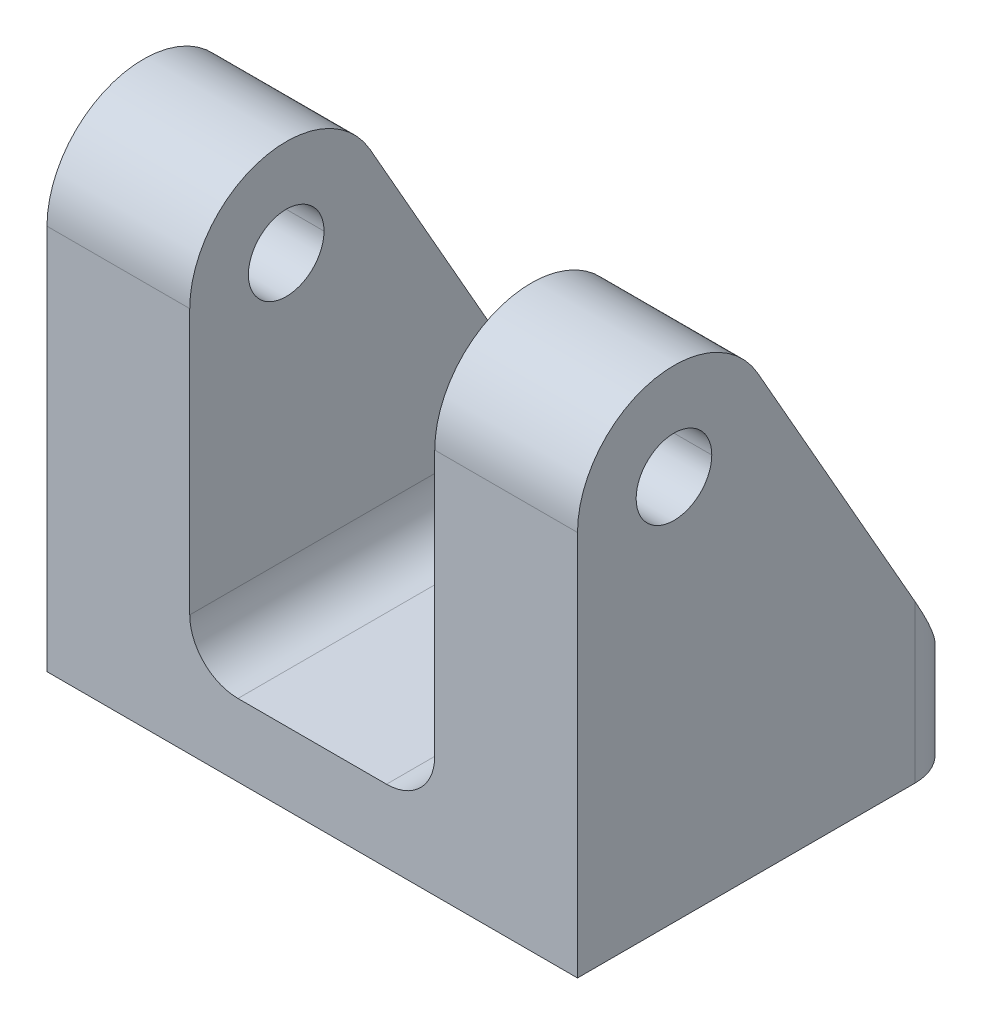
ISO-10303-21;
HEADER;
FILE_DESCRIPTION(('STEP AP214'),'2;1');
FILE_NAME('part.step','',(''),(''),'','','');
FILE_SCHEMA(('AUTOMOTIVE_DESIGN { 1 0 10303 214 1 1 1 1 }'));
ENDSEC;
DATA;
#1=APPLICATION_CONTEXT('core data for automotive mechanical design processes');
#2=APPLICATION_PROTOCOL_DEFINITION('international standard','automotive_design',2000,#1);
#3=PRODUCT_CONTEXT('',#1,'mechanical');
#4=PRODUCT('Part','Part','',(#3));
#5=PRODUCT_RELATED_PRODUCT_CATEGORY('part','',(#4));
#6=PRODUCT_DEFINITION_FORMATION('','',#4);
#7=PRODUCT_DEFINITION_CONTEXT('part definition',#1,'design');
#8=PRODUCT_DEFINITION('design','',#6,#7);
#9=PRODUCT_DEFINITION_SHAPE('','',#8);
#10=(LENGTH_UNIT() NAMED_UNIT(*) SI_UNIT(.MILLI.,.METRE.));
#11=(NAMED_UNIT(*) PLANE_ANGLE_UNIT() SI_UNIT($,.RADIAN.));
#12=(NAMED_UNIT(*) SI_UNIT($,.STERADIAN.) SOLID_ANGLE_UNIT());
#13=UNCERTAINTY_MEASURE_WITH_UNIT(LENGTH_MEASURE(1.E-05),#10,'distance_accuracy_value','');
#14=(GEOMETRIC_REPRESENTATION_CONTEXT(3) GLOBAL_UNCERTAINTY_ASSIGNED_CONTEXT((#13)) GLOBAL_UNIT_ASSIGNED_CONTEXT((#10,
#11,#12)) REPRESENTATION_CONTEXT('',''));
#15=CARTESIAN_POINT('',(0.,0.,0.));
#16=DIRECTION('',(0.,0.,1.));
#17=DIRECTION('',(1.,0.,0.));
#18=AXIS2_PLACEMENT_3D('',#15,#16,#17);
#19=CARTESIAN_POINT('',(4.8895,7.9375,-12.7));
#20=DIRECTION('',(0.,0.,-1.));
#21=DIRECTION('',(-1.,0.,0.));
#22=AXIS2_PLACEMENT_3D('',#19,#20,#21);
#23=CYLINDRICAL_SURFACE('',#22,3.175);
#24=CARTESIAN_POINT('',(4.8895,4.7625,-12.7));
#25=CARTESIAN_POINT('',(6.74937193946543,4.7625,-12.7));
#26=CARTESIAN_POINT('',(8.06450000000001,6.07762806053458,-11.9516212349029));
#27=CARTESIAN_POINT('',(8.0645,7.9375,-10.8932538355104));
#28=(BOUNDED_CURVE() B_SPLINE_CURVE(3,(#24,#25,#26,#27),.UNSPECIFIED.,.F.,
.F.) B_SPLINE_CURVE_WITH_KNOTS((4,4),(0.,1.5707963267949),
.UNSPECIFIED.) CURVE() GEOMETRIC_REPRESENTATION_ITEM() RATIONAL_B_SPLINE_CURVE((1.,
0.804737854124365,0.804737854124365,1.)) REPRESENTATION_ITEM(''));
#29=CARTESIAN_POINT('',(4.8895,4.7625,-12.7));
#30=VERTEX_POINT('',#29);
#31=CARTESIAN_POINT('',(8.0645,7.9375,-10.8932538355104));
#32=VERTEX_POINT('',#31);
#33=EDGE_CURVE('E396',#30,#32,#28,.T.);
#34=ORIENTED_EDGE('',*,*,#33,.F.);
#35=DIRECTION('',(0.,0.,-1.));
#36=VECTOR('',#35,1.);
#37=CARTESIAN_POINT('',(4.8895,4.7625,-12.7));
#38=LINE('',#37,#36);
#39=CARTESIAN_POINT('',(4.8895,4.7625,12.7));
#40=VERTEX_POINT('',#39);
#41=EDGE_CURVE('E316',#40,#30,#38,.T.);
#42=ORIENTED_EDGE('',*,*,#41,.F.);
#43=CARTESIAN_POINT('',(4.8895,7.9375,12.7));
#44=DIRECTION('',(0.,0.,-1.));
#45=DIRECTION('',(0.,-1.,0.));
#46=AXIS2_PLACEMENT_3D('',#43,#44,#45);
#47=CIRCLE('',#46,3.175);
#48=CARTESIAN_POINT('',(8.0645,7.9375,12.7));
#49=VERTEX_POINT('',#48);
#50=EDGE_CURVE('E467',#49,#40,#47,.T.);
#51=ORIENTED_EDGE('',*,*,#50,.F.);
#52=DIRECTION('',(0.,0.,1.));
#53=VECTOR('',#52,1.);
#54=CARTESIAN_POINT('',(8.0645,7.9375,12.7));
#55=LINE('',#54,#53);
#56=EDGE_CURVE('E317',#32,#49,#55,.T.);
#57=ORIENTED_EDGE('',*,*,#56,.F.);
#58=EDGE_LOOP('',(#34,#42,#51,#57));
#59=FACE_BOUND('',#58,.T.);
#60=ADVANCED_FACE('F16',(#59),#23,.F.);
#61=CARTESIAN_POINT('',(-4.8895,7.9375,-12.7));
#62=DIRECTION('',(0.,0.,-1.));
#63=DIRECTION('',(-1.,0.,0.));
#64=AXIS2_PLACEMENT_3D('',#61,#62,#63);
#65=CYLINDRICAL_SURFACE('',#64,3.175);
#66=CARTESIAN_POINT('',(-8.0645,7.9375,-10.8932538355104));
#67=CARTESIAN_POINT('',(-8.0645,6.07762806053458,-11.9516212349029));
#68=CARTESIAN_POINT('',(-6.74937193946543,4.7625,-12.7));
#69=CARTESIAN_POINT('',(-4.8895,4.7625,-12.7));
#70=(BOUNDED_CURVE() B_SPLINE_CURVE(3,(#66,#67,#68,#69),.UNSPECIFIED.,.F.,
.F.) B_SPLINE_CURVE_WITH_KNOTS((4,4),(4.71238898038469,6.28318530717959),
.UNSPECIFIED.) CURVE() GEOMETRIC_REPRESENTATION_ITEM() RATIONAL_B_SPLINE_CURVE((1.,
0.804737854124365,0.804737854124365,1.)) REPRESENTATION_ITEM(''));
#71=CARTESIAN_POINT('',(-8.0645,7.9375,-10.8932538355104));
#72=VERTEX_POINT('',#71);
#73=CARTESIAN_POINT('',(-4.8895,4.7625,-12.7));
#74=VERTEX_POINT('',#73);
#75=EDGE_CURVE('E269',#72,#74,#70,.T.);
#76=ORIENTED_EDGE('',*,*,#75,.F.);
#77=DIRECTION('',(0.,0.,-1.));
#78=VECTOR('',#77,1.);
#79=CARTESIAN_POINT('',(-8.0645,7.9375,-12.7));
#80=LINE('',#79,#78);
#81=CARTESIAN_POINT('',(-8.0645,7.9375,12.7));
#82=VERTEX_POINT('',#81);
#83=EDGE_CURVE('E352',#82,#72,#80,.T.);
#84=ORIENTED_EDGE('',*,*,#83,.F.);
#85=CARTESIAN_POINT('',(-4.8895,7.9375,12.7));
#86=DIRECTION('',(0.,0.,-1.));
#87=DIRECTION('',(0.,-1.,0.));
#88=AXIS2_PLACEMENT_3D('',#85,#86,#87);
#89=CIRCLE('',#88,3.175);
#90=CARTESIAN_POINT('',(-4.8895,4.7625,12.7));
#91=VERTEX_POINT('',#90);
#92=EDGE_CURVE('E295',#91,#82,#89,.T.);
#93=ORIENTED_EDGE('',*,*,#92,.F.);
#94=DIRECTION('',(0.,0.,1.));
#95=VECTOR('',#94,1.);
#96=CARTESIAN_POINT('',(-4.8895,4.7625,12.7));
#97=LINE('',#96,#95);
#98=EDGE_CURVE('E312',#74,#91,#97,.T.);
#99=ORIENTED_EDGE('',*,*,#98,.F.);
#100=EDGE_LOOP('',(#76,#84,#93,#99));
#101=FACE_BOUND('',#100,.T.);
#102=ADVANCED_FACE('F553',(#101),#65,.F.);
#103=CARTESIAN_POINT('',(12.7,0.,0.));
#104=DIRECTION('',(0.,-1.,0.));
#105=DIRECTION('',(0.,0.,-1.));
#106=AXIS2_PLACEMENT_3D('',#103,#104,#105);
#107=CYLINDRICAL_SURFACE('',#106,2.0193);
#108=DIRECTION('',(0.,-1.,0.));
#109=VECTOR('',#108,1.);
#110=CARTESIAN_POINT('',(12.7,0.,2.0193));
#111=LINE('',#110,#109);
#112=CARTESIAN_POINT('',(12.7,19.05,2.0193));
#113=VERTEX_POINT('',#112);
#114=CARTESIAN_POINT('',(12.7,0.,2.0193));
#115=VERTEX_POINT('',#114);
#116=EDGE_CURVE('E379',#113,#115,#111,.T.);
#117=ORIENTED_EDGE('',*,*,#116,.F.);
#118=CARTESIAN_POINT('',(12.7,19.05,0.));
#119=DIRECTION('',(0.,-1.,0.));
#120=DIRECTION('',(0.,0.,-1.));
#121=AXIS2_PLACEMENT_3D('',#118,#119,#120);
#122=CIRCLE('',#121,2.0193);
#123=CARTESIAN_POINT('',(12.7,19.05,-2.0193));
#124=VERTEX_POINT('',#123);
#125=EDGE_CURVE('E11',#124,#113,#122,.T.);
#126=ORIENTED_EDGE('',*,*,#125,.F.);
#127=DIRECTION('',(0.,-1.,0.));
#128=VECTOR('',#127,1.);
#129=CARTESIAN_POINT('',(12.7,0.,-2.0193));
#130=LINE('',#129,#128);
#131=CARTESIAN_POINT('',(12.7,0.,-2.0193));
#132=VERTEX_POINT('',#131);
#133=EDGE_CURVE('E320',#124,#132,#130,.T.);
#134=ORIENTED_EDGE('',*,*,#133,.T.);
#135=CARTESIAN_POINT('',(12.7,0.,0.));
#136=DIRECTION('',(0.,-1.,0.));
#137=DIRECTION('',(0.,0.,-1.));
#138=AXIS2_PLACEMENT_3D('',#135,#136,#137);
#139=CIRCLE('',#138,2.0193);
#140=EDGE_CURVE('E334',#132,#115,#139,.T.);
#141=ORIENTED_EDGE('',*,*,#140,.T.);
#142=EDGE_LOOP('',(#117,#126,#134,#141));
#143=FACE_BOUND('',#142,.T.);
#144=ADVANCED_FACE('F532',(#143),#107,.F.);
#145=CARTESIAN_POINT('',(12.7,19.05,0.));
#146=DIRECTION('',(0.,-1.,0.));
#147=DIRECTION('',(0.,0.,-1.));
#148=AXIS2_PLACEMENT_3D('',#145,#146,#147);
#149=CONICAL_SURFACE('',#148,2.0193,1.02974425867665);
#150=DIRECTION('',(0.,-0.515038074910057,0.857167300702111));
#151=VECTOR('',#150,1.);
#152=CARTESIAN_POINT('',(12.7,19.05,2.0193));
#153=LINE('',#152,#151);
#154=CARTESIAN_POINT('',(12.7,20.2633178480023,0.));
#155=VERTEX_POINT('',#154);
#156=EDGE_CURVE('E201',#155,#113,#153,.T.);
#157=ORIENTED_EDGE('',*,*,#156,.F.);
#158=DIRECTION('',(0.,-0.515038074910057,-0.857167300702111));
#159=VECTOR('',#158,1.);
#160=CARTESIAN_POINT('',(12.7,19.05,-2.0193));
#161=LINE('',#160,#159);
#162=EDGE_CURVE('E299',#155,#124,#161,.T.);
#163=ORIENTED_EDGE('',*,*,#162,.T.);
#164=ORIENTED_EDGE('',*,*,#125,.T.);
#165=EDGE_LOOP('',(#157,#163,#164));
#166=FACE_BOUND('',#165,.T.);
#167=ADVANCED_FACE('F541',(#166),#149,.F.);
#168=CARTESIAN_POINT('',(-12.7,0.,0.));
#169=DIRECTION('',(0.,-1.,0.));
#170=DIRECTION('',(0.,0.,-1.));
#171=AXIS2_PLACEMENT_3D('',#168,#169,#170);
#172=CYLINDRICAL_SURFACE('',#171,2.0193);
#173=DIRECTION('',(0.,-1.,0.));
#174=VECTOR('',#173,1.);
#175=CARTESIAN_POINT('',(-12.7,0.,2.0193));
#176=LINE('',#175,#174);
#177=CARTESIAN_POINT('',(-12.7,19.05,2.0193));
#178=VERTEX_POINT('',#177);
#179=CARTESIAN_POINT('',(-12.7,0.,2.0193));
#180=VERTEX_POINT('',#179);
#181=EDGE_CURVE('E329',#178,#180,#176,.T.);
#182=ORIENTED_EDGE('',*,*,#181,.F.);
#183=CARTESIAN_POINT('',(-12.7,19.05,0.));
#184=DIRECTION('',(0.,-1.,0.));
#185=DIRECTION('',(0.,0.,-1.));
#186=AXIS2_PLACEMENT_3D('',#183,#184,#185);
#187=CIRCLE('',#186,2.0193);
#188=CARTESIAN_POINT('',(-12.7,19.05,-2.0193));
#189=VERTEX_POINT('',#188);
#190=EDGE_CURVE('E27',#189,#178,#187,.T.);
#191=ORIENTED_EDGE('',*,*,#190,.F.);
#192=DIRECTION('',(0.,-1.,0.));
#193=VECTOR('',#192,1.);
#194=CARTESIAN_POINT('',(-12.7,0.,-2.0193));
#195=LINE('',#194,#193);
#196=CARTESIAN_POINT('',(-12.7,0.,-2.0193));
#197=VERTEX_POINT('',#196);
#198=EDGE_CURVE('E328',#189,#197,#195,.T.);
#199=ORIENTED_EDGE('',*,*,#198,.T.);
#200=CARTESIAN_POINT('',(-12.7,0.,0.));
#201=DIRECTION('',(0.,-1.,0.));
#202=DIRECTION('',(0.,0.,-1.));
#203=AXIS2_PLACEMENT_3D('',#200,#201,#202);
#204=CIRCLE('',#203,2.0193);
#205=EDGE_CURVE('E330',#197,#180,#204,.T.);
#206=ORIENTED_EDGE('',*,*,#205,.T.);
#207=EDGE_LOOP('',(#182,#191,#199,#206));
#208=FACE_BOUND('',#207,.T.);
#209=ADVANCED_FACE('F543',(#208),#172,.F.);
#210=CARTESIAN_POINT('',(-12.7,19.05,0.));
#211=DIRECTION('',(0.,-1.,0.));
#212=DIRECTION('',(0.,0.,-1.));
#213=AXIS2_PLACEMENT_3D('',#210,#211,#212);
#214=CONICAL_SURFACE('',#213,2.0193,1.02974425867665);
#215=DIRECTION('',(0.,-0.515038074910057,0.857167300702111));
#216=VECTOR('',#215,1.);
#217=CARTESIAN_POINT('',(-12.7,19.05,2.0193));
#218=LINE('',#217,#216);
#219=CARTESIAN_POINT('',(-12.7,20.2633178480023,0.));
#220=VERTEX_POINT('',#219);
#221=EDGE_CURVE('E465',#220,#178,#218,.T.);
#222=ORIENTED_EDGE('',*,*,#221,.F.);
#223=DIRECTION('',(0.,-0.515038074910057,-0.857167300702111));
#224=VECTOR('',#223,1.);
#225=CARTESIAN_POINT('',(-12.7,19.05,-2.0193));
#226=LINE('',#225,#224);
#227=EDGE_CURVE('E462',#220,#189,#226,.T.);
#228=ORIENTED_EDGE('',*,*,#227,.T.);
#229=ORIENTED_EDGE('',*,*,#190,.T.);
#230=EDGE_LOOP('',(#222,#228,#229));
#231=FACE_BOUND('',#230,.T.);
#232=ADVANCED_FACE('F550',(#231),#214,.F.);
#233=CARTESIAN_POINT('',(0.,0.,0.));
#234=DIRECTION('',(0.,-1.,0.));
#235=DIRECTION('',(0.,0.,-1.));
#236=AXIS2_PLACEMENT_3D('',#233,#234,#235);
#237=CYLINDRICAL_SURFACE('',#236,2.0193);
#238=DIRECTION('',(0.,-1.,0.));
#239=VECTOR('',#238,1.);
#240=CARTESIAN_POINT('',(0.,0.,2.0193));
#241=LINE('',#240,#239);
#242=CARTESIAN_POINT('',(0.,4.7625,2.0193));
#243=VERTEX_POINT('',#242);
#244=CARTESIAN_POINT('',(0.,0.,2.0193));
#245=VERTEX_POINT('',#244);
#246=EDGE_CURVE('E289',#243,#245,#241,.T.);
#247=ORIENTED_EDGE('',*,*,#246,.F.);
#248=CARTESIAN_POINT('',(0.,4.7625,0.));
#249=DIRECTION('',(0.,-1.,0.));
#250=DIRECTION('',(1.,0.,0.));
#251=AXIS2_PLACEMENT_3D('',#248,#249,#250);
#252=CIRCLE('',#251,2.0193);
#253=CARTESIAN_POINT('',(0.,4.7625,-2.0193));
#254=VERTEX_POINT('',#253);
#255=EDGE_CURVE('E405',#254,#243,#252,.T.);
#256=ORIENTED_EDGE('',*,*,#255,.F.);
#257=DIRECTION('',(0.,-1.,0.));
#258=VECTOR('',#257,1.);
#259=CARTESIAN_POINT('',(0.,0.,-2.0193));
#260=LINE('',#259,#258);
#261=CARTESIAN_POINT('',(0.,0.,-2.0193));
#262=VERTEX_POINT('',#261);
#263=EDGE_CURVE('E288',#254,#262,#260,.T.);
#264=ORIENTED_EDGE('',*,*,#263,.T.);
#265=CARTESIAN_POINT('',(0.,0.,0.));
#266=DIRECTION('',(0.,-1.,0.));
#267=DIRECTION('',(0.,0.,-1.));
#268=AXIS2_PLACEMENT_3D('',#265,#266,#267);
#269=CIRCLE('',#268,2.0193);
#270=EDGE_CURVE('E333',#262,#245,#269,.T.);
#271=ORIENTED_EDGE('',*,*,#270,.T.);
#272=EDGE_LOOP('',(#247,#256,#264,#271));
#273=FACE_BOUND('',#272,.T.);
#274=ADVANCED_FACE('F613',(#273),#237,.F.);
#275=CARTESIAN_POINT('',(-14.2875,0.,-9.525));
#276=DIRECTION('',(0.,1.,0.));
#277=DIRECTION('',(0.,0.,1.));
#278=AXIS2_PLACEMENT_3D('',#275,#276,#277);
#279=CYLINDRICAL_SURFACE('',#278,3.175);
#280=CARTESIAN_POINT('',(-14.2875,4.7625,-12.7));
#281=CARTESIAN_POINT('',(-16.1473719394654,4.76250000000002,-12.7));
#282=CARTESIAN_POINT('',(-17.4625,7.07357815489786,-11.3848719394654));
#283=CARTESIAN_POINT('',(-17.4625,10.3419362252586,-9.525));
#284=(BOUNDED_CURVE() B_SPLINE_CURVE(3,(#280,#281,#282,#283),.UNSPECIFIED.,.F.,
.F.) B_SPLINE_CURVE_WITH_KNOTS((4,4),(3.1415926535898,4.71238898038469),
.UNSPECIFIED.) CURVE() GEOMETRIC_REPRESENTATION_ITEM() RATIONAL_B_SPLINE_CURVE((1.,
0.804737854124365,0.804737854124365,1.)) REPRESENTATION_ITEM(''));
#285=CARTESIAN_POINT('',(-14.2875,4.7625,-12.7));
#286=VERTEX_POINT('',#285);
#287=CARTESIAN_POINT('',(-17.4625,10.3419362252586,-9.525));
#288=VERTEX_POINT('',#287);
#289=EDGE_CURVE('E447',#286,#288,#284,.T.);
#290=ORIENTED_EDGE('',*,*,#289,.F.);
#291=DIRECTION('',(0.,1.,0.));
#292=VECTOR('',#291,1.);
#293=CARTESIAN_POINT('',(-14.2875,4.7625,-12.7));
#294=LINE('',#293,#292);
#295=CARTESIAN_POINT('',(-14.2875,0.,-12.7));
#296=VERTEX_POINT('',#295);
#297=EDGE_CURVE('E492',#296,#286,#294,.T.);
#298=ORIENTED_EDGE('',*,*,#297,.F.);
#299=CARTESIAN_POINT('',(-14.2875,0.,-9.525));
#300=DIRECTION('',(0.,-1.,0.));
#301=DIRECTION('',(0.,0.,-1.));
#302=AXIS2_PLACEMENT_3D('',#299,#300,#301);
#303=CIRCLE('',#302,3.175);
#304=CARTESIAN_POINT('',(-17.4625,0.,-9.525));
#305=VERTEX_POINT('',#304);
#306=EDGE_CURVE('E341',#305,#296,#303,.T.);
#307=ORIENTED_EDGE('',*,*,#306,.F.);
#308=DIRECTION('',(0.,-1.,0.));
#309=VECTOR('',#308,1.);
#310=CARTESIAN_POINT('',(-17.4625,0.,-9.525));
#311=LINE('',#310,#309);
#312=EDGE_CURVE('E42',#288,#305,#311,.T.);
#313=ORIENTED_EDGE('',*,*,#312,.F.);
#314=EDGE_LOOP('',(#290,#298,#307,#313));
#315=FACE_BOUND('',#314,.T.);
#316=ADVANCED_FACE('F572',(#315),#279,.T.);
#317=CARTESIAN_POINT('',(14.2875,0.,-9.525));
#318=DIRECTION('',(0.,-1.,0.));
#319=DIRECTION('',(0.,0.,-1.));
#320=AXIS2_PLACEMENT_3D('',#317,#318,#319);
#321=CYLINDRICAL_SURFACE('',#320,3.175);
#322=CARTESIAN_POINT('',(17.4625,10.3419362252586,-9.525));
#323=CARTESIAN_POINT('',(17.4625,7.07357815489786,-11.3848719394654));
#324=CARTESIAN_POINT('',(16.1473719394654,4.76250000000001,-12.7));
#325=CARTESIAN_POINT('',(14.2875,4.7625,-12.7));
#326=(BOUNDED_CURVE() B_SPLINE_CURVE(3,(#322,#323,#324,#325),.UNSPECIFIED.,.F.,
.F.) B_SPLINE_CURVE_WITH_KNOTS((4,4),(4.71238898038469,6.28318530717959),
.UNSPECIFIED.) CURVE() GEOMETRIC_REPRESENTATION_ITEM() RATIONAL_B_SPLINE_CURVE((1.,
0.804737854124365,0.804737854124365,1.)) REPRESENTATION_ITEM(''));
#327=CARTESIAN_POINT('',(17.4625,10.3419362252586,-9.525));
#328=VERTEX_POINT('',#327);
#329=CARTESIAN_POINT('',(14.2875,4.7625,-12.7));
#330=VERTEX_POINT('',#329);
#331=EDGE_CURVE('E355',#328,#330,#326,.T.);
#332=ORIENTED_EDGE('',*,*,#331,.F.);
#333=DIRECTION('',(0.,1.,0.));
#334=VECTOR('',#333,1.);
#335=CARTESIAN_POINT('',(17.4625,0.,-9.525));
#336=LINE('',#335,#334);
#337=CARTESIAN_POINT('',(17.4625,0.,-9.525));
#338=VERTEX_POINT('',#337);
#339=EDGE_CURVE('E374',#338,#328,#336,.T.);
#340=ORIENTED_EDGE('',*,*,#339,.F.);
#341=CARTESIAN_POINT('',(14.2875,0.,-9.525));
#342=DIRECTION('',(0.,-1.,0.));
#343=DIRECTION('',(0.,0.,-1.));
#344=AXIS2_PLACEMENT_3D('',#341,#342,#343);
#345=CIRCLE('',#344,3.175);
#346=CARTESIAN_POINT('',(14.2875,0.,-12.7));
#347=VERTEX_POINT('',#346);
#348=EDGE_CURVE('E294',#347,#338,#345,.T.);
#349=ORIENTED_EDGE('',*,*,#348,.F.);
#350=DIRECTION('',(0.,-1.,0.));
#351=VECTOR('',#350,1.);
#352=CARTESIAN_POINT('',(14.2875,0.,-12.7));
#353=LINE('',#352,#351);
#354=EDGE_CURVE('E399',#330,#347,#353,.T.);
#355=ORIENTED_EDGE('',*,*,#354,.F.);
#356=EDGE_LOOP('',(#332,#340,#349,#355));
#357=FACE_BOUND('',#356,.T.);
#358=ADVANCED_FACE('F568',(#357),#321,.T.);
#359=CARTESIAN_POINT('',(-8.0645,4.7625,-12.7));
#360=DIRECTION('',(0.,-1.,0.));
#361=DIRECTION('',(0.,0.,-1.));
#362=AXIS2_PLACEMENT_3D('',#359,#360,#361);
#363=PLANE('',#362);
#364=ORIENTED_EDGE('',*,*,#255,.T.);
#365=CARTESIAN_POINT('',(0.,4.7625,0.));
#366=DIRECTION('',(0.,-1.,0.));
#367=DIRECTION('',(1.,0.,0.));
#368=AXIS2_PLACEMENT_3D('',#365,#366,#367);
#369=CIRCLE('',#368,2.0193);
#370=EDGE_CURVE('E348',#243,#254,#369,.T.);
#371=ORIENTED_EDGE('',*,*,#370,.T.);
#372=EDGE_LOOP('',(#364,#371));
#373=FACE_BOUND('',#372,.T.);
#374=DIRECTION('',(1.,0.,0.));
#375=VECTOR('',#374,1.);
#376=CARTESIAN_POINT('',(-8.0645,4.7625,-12.7));
#377=LINE('',#376,#375);
#378=EDGE_CURVE('E488',#74,#30,#377,.T.);
#379=ORIENTED_EDGE('',*,*,#378,.F.);
#380=ORIENTED_EDGE('',*,*,#98,.T.);
#381=DIRECTION('',(1.,0.,0.));
#382=VECTOR('',#381,1.);
#383=CARTESIAN_POINT('',(-8.0645,4.7625,12.7));
#384=LINE('',#383,#382);
#385=EDGE_CURVE('E340',#91,#40,#384,.T.);
#386=ORIENTED_EDGE('',*,*,#385,.T.);
#387=ORIENTED_EDGE('',*,*,#41,.T.);
#388=EDGE_LOOP('',(#379,#380,#386,#387));
#389=FACE_BOUND('',#388,.T.);
#390=ADVANCED_FACE('F571',(#373,#389),#363,.F.);
#391=CARTESIAN_POINT('',(8.0645,4.7625,-12.7));
#392=DIRECTION('',(1.,0.,0.));
#393=DIRECTION('',(0.,1.,0.));
#394=AXIS2_PLACEMENT_3D('',#391,#392,#393);
#395=PLANE('',#394);
#396=CARTESIAN_POINT('',(8.0645,25.4,6.35));
#397=DIRECTION('',(1.,0.,0.));
#398=DIRECTION('',(0.,1.,0.));
#399=AXIS2_PLACEMENT_3D('',#396,#397,#398);
#400=CIRCLE('',#399,2.4892);
#401=CARTESIAN_POINT('',(8.0645,25.4,8.8392));
#402=VERTEX_POINT('',#401);
#403=CARTESIAN_POINT('',(8.0645,25.4,3.8608));
#404=VERTEX_POINT('',#403);
#405=EDGE_CURVE('E304',#402,#404,#400,.T.);
#406=ORIENTED_EDGE('',*,*,#405,.T.);
#407=CARTESIAN_POINT('',(8.0645,25.4,6.35));
#408=DIRECTION('',(1.,0.,0.));
#409=DIRECTION('',(0.,1.,0.));
#410=AXIS2_PLACEMENT_3D('',#407,#408,#409);
#411=CIRCLE('',#410,2.4892);
#412=EDGE_CURVE('E402',#404,#402,#411,.T.);
#413=ORIENTED_EDGE('',*,*,#412,.T.);
#414=EDGE_LOOP('',(#406,#413));
#415=FACE_BOUND('',#414,.T.);
#416=DIRECTION('',(0.,0.869130808993556,0.494582285224821));
#417=VECTOR('',#416,1.);
#418=CARTESIAN_POINT('',(8.0645,6.62414303176311,-11.6406247536105));
#419=LINE('',#418,#417);
#420=CARTESIAN_POINT('',(8.0645,28.5405975111776,0.831019362890917));
#421=VERTEX_POINT('',#420);
#422=EDGE_CURVE('E413',#32,#421,#419,.T.);
#423=ORIENTED_EDGE('',*,*,#422,.F.);
#424=ORIENTED_EDGE('',*,*,#56,.T.);
#425=DIRECTION('',(0.,1.,0.));
#426=VECTOR('',#425,1.);
#427=CARTESIAN_POINT('',(8.0645,4.7625,12.7));
#428=LINE('',#427,#426);
#429=CARTESIAN_POINT('',(8.0645,25.4,12.7));
#430=VERTEX_POINT('',#429);
#431=EDGE_CURVE('E282',#49,#430,#428,.T.);
#432=ORIENTED_EDGE('',*,*,#431,.T.);
#433=CARTESIAN_POINT('',(8.0645,25.4,6.35));
#434=DIRECTION('',(1.,0.,0.));
#435=DIRECTION('',(0.,1.,0.));
#436=AXIS2_PLACEMENT_3D('',#433,#434,#435);
#437=CIRCLE('',#436,6.35);
#438=EDGE_CURVE('E414',#421,#430,#437,.T.);
#439=ORIENTED_EDGE('',*,*,#438,.F.);
#440=EDGE_LOOP('',(#423,#424,#432,#439));
#441=FACE_BOUND('',#440,.T.);
#442=ADVANCED_FACE('F598',(#415,#441),#395,.F.);
#443=CARTESIAN_POINT('',(-8.0645,4.7625,-12.7));
#444=DIRECTION('',(-1.,0.,0.));
#445=DIRECTION('',(0.,0.,1.));
#446=AXIS2_PLACEMENT_3D('',#443,#444,#445);
#447=PLANE('',#446);
#448=CARTESIAN_POINT('',(-8.0645,25.4,6.35));
#449=DIRECTION('',(-1.,0.,0.));
#450=DIRECTION('',(0.,0.,1.));
#451=AXIS2_PLACEMENT_3D('',#448,#449,#450);
#452=CIRCLE('',#451,2.4892);
#453=CARTESIAN_POINT('',(-8.0645,25.4,8.8392));
#454=VERTEX_POINT('',#453);
#455=CARTESIAN_POINT('',(-8.0645,25.4,3.8608));
#456=VERTEX_POINT('',#455);
#457=EDGE_CURVE('E261',#454,#456,#452,.T.);
#458=ORIENTED_EDGE('',*,*,#457,.T.);
#459=CARTESIAN_POINT('',(-8.0645,25.4,6.35));
#460=DIRECTION('',(-1.,0.,0.));
#461=DIRECTION('',(0.,0.,1.));
#462=AXIS2_PLACEMENT_3D('',#459,#460,#461);
#463=CIRCLE('',#462,2.4892);
#464=EDGE_CURVE('E363',#456,#454,#463,.T.);
#465=ORIENTED_EDGE('',*,*,#464,.T.);
#466=EDGE_LOOP('',(#458,#465));
#467=FACE_BOUND('',#466,.T.);
#468=DIRECTION('',(0.,-1.,0.));
#469=VECTOR('',#468,1.);
#470=CARTESIAN_POINT('',(-8.0645,4.7625,12.7));
#471=LINE('',#470,#469);
#472=CARTESIAN_POINT('',(-8.0645,25.4,12.7));
#473=VERTEX_POINT('',#472);
#474=EDGE_CURVE('E251',#473,#82,#471,.T.);
#475=ORIENTED_EDGE('',*,*,#474,.T.);
#476=ORIENTED_EDGE('',*,*,#83,.T.);
#477=DIRECTION('',(0.,-0.869130808993556,-0.494582285224821));
#478=VECTOR('',#477,1.);
#479=CARTESIAN_POINT('',(-8.0645,6.62414303176311,-11.6406247536105));
#480=LINE('',#479,#478);
#481=CARTESIAN_POINT('',(-8.0645,28.5405975111776,0.831019362890917));
#482=VERTEX_POINT('',#481);
#483=EDGE_CURVE('E278',#482,#72,#480,.T.);
#484=ORIENTED_EDGE('',*,*,#483,.F.);
#485=CARTESIAN_POINT('',(-8.0645,25.4,6.35));
#486=DIRECTION('',(-1.,0.,0.));
#487=DIRECTION('',(0.,0.,1.));
#488=AXIS2_PLACEMENT_3D('',#485,#486,#487);
#489=CIRCLE('',#488,6.35);
#490=EDGE_CURVE('E262',#473,#482,#489,.T.);
#491=ORIENTED_EDGE('',*,*,#490,.F.);
#492=EDGE_LOOP('',(#475,#476,#484,#491));
#493=FACE_BOUND('',#492,.T.);
#494=ADVANCED_FACE('F601',(#467,#493),#447,.F.);
#495=CARTESIAN_POINT('',(-17.4625,0.,0.));
#496=DIRECTION('',(1.,0.,0.));
#497=DIRECTION('',(0.,1.,0.));
#498=AXIS2_PLACEMENT_3D('',#495,#496,#497);
#499=PLANE('',#498);
#500=CARTESIAN_POINT('',(-17.4625,25.4,6.35));
#501=DIRECTION('',(1.,0.,0.));
#502=DIRECTION('',(0.,0.,-1.));
#503=AXIS2_PLACEMENT_3D('',#500,#501,#502);
#504=CIRCLE('',#503,2.4892);
#505=CARTESIAN_POINT('',(-17.4625,25.4,8.8392));
#506=VERTEX_POINT('',#505);
#507=CARTESIAN_POINT('',(-17.4625,25.4,3.8608));
#508=VERTEX_POINT('',#507);
#509=EDGE_CURVE('E505',#506,#508,#504,.T.);
#510=ORIENTED_EDGE('',*,*,#509,.T.);
#511=CARTESIAN_POINT('',(-17.4625,25.4,6.35));
#512=DIRECTION('',(1.,0.,0.));
#513=DIRECTION('',(0.,0.,-1.));
#514=AXIS2_PLACEMENT_3D('',#511,#512,#513);
#515=CIRCLE('',#514,2.4892);
#516=EDGE_CURVE('E311',#508,#506,#515,.T.);
#517=ORIENTED_EDGE('',*,*,#516,.T.);
#518=EDGE_LOOP('',(#510,#517));
#519=FACE_BOUND('',#518,.T.);
#520=DIRECTION('',(0.,0.869130808993556,0.494582285224821));
#521=VECTOR('',#520,1.);
#522=CARTESIAN_POINT('',(-17.4625,6.62414303176311,-11.6406247536105));
#523=LINE('',#522,#521);
#524=CARTESIAN_POINT('',(-17.4625,28.5405975111776,0.831019362890918));
#525=VERTEX_POINT('',#524);
#526=EDGE_CURVE('E308',#288,#525,#523,.T.);
#527=ORIENTED_EDGE('',*,*,#526,.F.);
#528=ORIENTED_EDGE('',*,*,#312,.T.);
#529=DIRECTION('',(0.,0.,1.));
#530=VECTOR('',#529,1.);
#531=CARTESIAN_POINT('',(-17.4625,0.,0.));
#532=LINE('',#531,#530);
#533=CARTESIAN_POINT('',(-17.4625,0.,12.7));
#534=VERTEX_POINT('',#533);
#535=EDGE_CURVE('E244',#305,#534,#532,.T.);
#536=ORIENTED_EDGE('',*,*,#535,.T.);
#537=DIRECTION('',(0.,1.,0.));
#538=VECTOR('',#537,1.);
#539=CARTESIAN_POINT('',(-17.4625,0.,12.7));
#540=LINE('',#539,#538);
#541=CARTESIAN_POINT('',(-17.4625,25.4,12.7));
#542=VERTEX_POINT('',#541);
#543=EDGE_CURVE('E238',#534,#542,#540,.T.);
#544=ORIENTED_EDGE('',*,*,#543,.T.);
#545=CARTESIAN_POINT('',(-17.4625,25.4,6.35));
#546=DIRECTION('',(1.,0.,0.));
#547=DIRECTION('',(0.,0.,-1.));
#548=AXIS2_PLACEMENT_3D('',#545,#546,#547);
#549=CIRCLE('',#548,6.35);
#550=EDGE_CURVE('E241',#525,#542,#549,.T.);
#551=ORIENTED_EDGE('',*,*,#550,.F.);
#552=EDGE_LOOP('',(#527,#528,#536,#544,#551));
#553=FACE_BOUND('',#552,.T.);
#554=ADVANCED_FACE('F240',(#519,#553),#499,.F.);
#555=CARTESIAN_POINT('',(17.4625,0.,0.));
#556=DIRECTION('',(1.,0.,0.));
#557=DIRECTION('',(0.,1.,0.));
#558=AXIS2_PLACEMENT_3D('',#555,#556,#557);
#559=PLANE('',#558);
#560=CARTESIAN_POINT('',(17.4625,25.4,6.35));
#561=DIRECTION('',(1.,0.,0.));
#562=DIRECTION('',(0.,0.,-1.));
#563=AXIS2_PLACEMENT_3D('',#560,#561,#562);
#564=CIRCLE('',#563,2.4892);
#565=CARTESIAN_POINT('',(17.4625,25.4,8.8392));
#566=VERTEX_POINT('',#565);
#567=CARTESIAN_POINT('',(17.4625,25.4,3.8608));
#568=VERTEX_POINT('',#567);
#569=EDGE_CURVE('E305',#566,#568,#564,.T.);
#570=ORIENTED_EDGE('',*,*,#569,.F.);
#571=CARTESIAN_POINT('',(17.4625,25.4,6.35));
#572=DIRECTION('',(1.,0.,0.));
#573=DIRECTION('',(0.,0.,-1.));
#574=AXIS2_PLACEMENT_3D('',#571,#572,#573);
#575=CIRCLE('',#574,2.4892);
#576=EDGE_CURVE('E435',#568,#566,#575,.T.);
#577=ORIENTED_EDGE('',*,*,#576,.F.);
#578=EDGE_LOOP('',(#570,#577));
#579=FACE_BOUND('',#578,.T.);
#580=DIRECTION('',(0.,0.,1.));
#581=VECTOR('',#580,1.);
#582=CARTESIAN_POINT('',(17.4625,0.,0.));
#583=LINE('',#582,#581);
#584=CARTESIAN_POINT('',(17.4625,0.,12.7));
#585=VERTEX_POINT('',#584);
#586=EDGE_CURVE('E392',#338,#585,#583,.T.);
#587=ORIENTED_EDGE('',*,*,#586,.F.);
#588=ORIENTED_EDGE('',*,*,#339,.T.);
#589=DIRECTION('',(0.,0.869130808993556,0.494582285224821));
#590=VECTOR('',#589,1.);
#591=CARTESIAN_POINT('',(17.4625,6.62414303176311,-11.6406247536105));
#592=LINE('',#591,#590);
#593=CARTESIAN_POINT('',(17.4625,28.5405975111776,0.831019362890918));
#594=VERTEX_POINT('',#593);
#595=EDGE_CURVE('E362',#328,#594,#592,.T.);
#596=ORIENTED_EDGE('',*,*,#595,.T.);
#597=CARTESIAN_POINT('',(17.4625,25.4,6.35));
#598=DIRECTION('',(1.,0.,0.));
#599=DIRECTION('',(0.,0.,-1.));
#600=AXIS2_PLACEMENT_3D('',#597,#598,#599);
#601=CIRCLE('',#600,6.35);
#602=CARTESIAN_POINT('',(17.4625,25.4,12.7));
#603=VERTEX_POINT('',#602);
#604=EDGE_CURVE('E337',#594,#603,#601,.T.);
#605=ORIENTED_EDGE('',*,*,#604,.T.);
#606=DIRECTION('',(0.,1.,0.));
#607=VECTOR('',#606,1.);
#608=CARTESIAN_POINT('',(17.4625,0.,12.7));
#609=LINE('',#608,#607);
#610=EDGE_CURVE('E349',#585,#603,#609,.T.);
#611=ORIENTED_EDGE('',*,*,#610,.F.);
#612=EDGE_LOOP('',(#587,#588,#596,#605,#611));
#613=FACE_BOUND('',#612,.T.);
#614=ADVANCED_FACE('F594',(#579,#613),#559,.T.);
#615=CARTESIAN_POINT('',(17.4625,25.4,6.35));
#616=DIRECTION('',(-1.,0.,0.));
#617=DIRECTION('',(0.,0.,1.));
#618=AXIS2_PLACEMENT_3D('',#615,#616,#617);
#619=CYLINDRICAL_SURFACE('',#618,2.4892);
#620=DIRECTION('',(-1.,0.,0.));
#621=VECTOR('',#620,1.);
#622=CARTESIAN_POINT('',(17.4625,25.4,3.8608));
#623=LINE('',#622,#621);
#624=EDGE_CURVE('E300',#568,#404,#623,.T.);
#625=ORIENTED_EDGE('',*,*,#624,.F.);
#626=ORIENTED_EDGE('',*,*,#576,.T.);
#627=DIRECTION('',(-1.,0.,0.));
#628=VECTOR('',#627,1.);
#629=CARTESIAN_POINT('',(17.4625,25.4,8.8392));
#630=LINE('',#629,#628);
#631=EDGE_CURVE('E371',#566,#402,#630,.T.);
#632=ORIENTED_EDGE('',*,*,#631,.T.);
#633=ORIENTED_EDGE('',*,*,#412,.F.);
#634=EDGE_LOOP('',(#625,#626,#632,#633));
#635=FACE_BOUND('',#634,.T.);
#636=ADVANCED_FACE('F592',(#635),#619,.F.);
#637=CARTESIAN_POINT('',(17.4625,0.,-12.7));
#638=DIRECTION('',(0.,0.,-1.));
#639=DIRECTION('',(0.,-1.,0.));
#640=AXIS2_PLACEMENT_3D('',#637,#638,#639);
#641=PLANE('',#640);
#642=DIRECTION('',(-1.,0.,0.));
#643=VECTOR('',#642,1.);
#644=CARTESIAN_POINT('',(17.4625,4.7625,-12.7));
#645=LINE('',#644,#643);
#646=EDGE_CURVE('E361',#330,#30,#645,.T.);
#647=ORIENTED_EDGE('',*,*,#646,.F.);
#648=ORIENTED_EDGE('',*,*,#354,.T.);
#649=DIRECTION('',(-1.,0.,0.));
#650=VECTOR('',#649,1.);
#651=CARTESIAN_POINT('',(17.4625,0.,-12.7));
#652=LINE('',#651,#650);
#653=EDGE_CURVE('E290',#347,#296,#652,.T.);
#654=ORIENTED_EDGE('',*,*,#653,.T.);
#655=ORIENTED_EDGE('',*,*,#297,.T.);
#656=DIRECTION('',(-1.,0.,0.));
#657=VECTOR('',#656,1.);
#658=CARTESIAN_POINT('',(17.4625,4.7625,-12.7));
#659=LINE('',#658,#657);
#660=EDGE_CURVE('E20',#74,#286,#659,.T.);
#661=ORIENTED_EDGE('',*,*,#660,.F.);
#662=ORIENTED_EDGE('',*,*,#378,.T.);
#663=EDGE_LOOP('',(#647,#648,#654,#655,#661,#662));
#664=FACE_BOUND('',#663,.T.);
#665=ADVANCED_FACE('F589',(#664),#641,.T.);
#666=CARTESIAN_POINT('',(17.4625,0.,0.));
#667=DIRECTION('',(0.,-1.,0.));
#668=DIRECTION('',(0.,0.,-1.));
#669=AXIS2_PLACEMENT_3D('',#666,#667,#668);
#670=PLANE('',#669);
#671=ORIENTED_EDGE('',*,*,#270,.F.);
#672=CARTESIAN_POINT('',(0.,0.,0.));
#673=DIRECTION('',(0.,-1.,0.));
#674=DIRECTION('',(0.,0.,-1.));
#675=AXIS2_PLACEMENT_3D('',#672,#673,#674);
#676=CIRCLE('',#675,2.0193);
#677=EDGE_CURVE('E284',#245,#262,#676,.T.);
#678=ORIENTED_EDGE('',*,*,#677,.F.);
#679=EDGE_LOOP('',(#671,#678));
#680=FACE_BOUND('',#679,.T.);
#681=ORIENTED_EDGE('',*,*,#205,.F.);
#682=CARTESIAN_POINT('',(-12.7,0.,0.));
#683=DIRECTION('',(0.,-1.,0.));
#684=DIRECTION('',(0.,0.,-1.));
#685=AXIS2_PLACEMENT_3D('',#682,#683,#684);
#686=CIRCLE('',#685,2.0193);
#687=EDGE_CURVE('E324',#180,#197,#686,.T.);
#688=ORIENTED_EDGE('',*,*,#687,.F.);
#689=EDGE_LOOP('',(#681,#688));
#690=FACE_BOUND('',#689,.T.);
#691=ORIENTED_EDGE('',*,*,#140,.F.);
#692=CARTESIAN_POINT('',(12.7,0.,0.));
#693=DIRECTION('',(0.,-1.,0.));
#694=DIRECTION('',(0.,0.,-1.));
#695=AXIS2_PLACEMENT_3D('',#692,#693,#694);
#696=CIRCLE('',#695,2.0193);
#697=EDGE_CURVE('E375',#115,#132,#696,.T.);
#698=ORIENTED_EDGE('',*,*,#697,.F.);
#699=EDGE_LOOP('',(#691,#698));
#700=FACE_BOUND('',#699,.T.);
#701=ORIENTED_EDGE('',*,*,#653,.F.);
#702=ORIENTED_EDGE('',*,*,#348,.T.);
#703=ORIENTED_EDGE('',*,*,#586,.T.);
#704=DIRECTION('',(-1.,0.,0.));
#705=VECTOR('',#704,1.);
#706=CARTESIAN_POINT('',(17.4625,0.,12.7));
#707=LINE('',#706,#705);
#708=EDGE_CURVE('E250',#585,#534,#707,.T.);
#709=ORIENTED_EDGE('',*,*,#708,.T.);
#710=ORIENTED_EDGE('',*,*,#535,.F.);
#711=ORIENTED_EDGE('',*,*,#306,.T.);
#712=EDGE_LOOP('',(#701,#702,#703,#709,#710,#711));
#713=FACE_BOUND('',#712,.T.);
#714=ADVANCED_FACE('F18',(#680,#690,#700,#713),#670,.T.);
#715=CARTESIAN_POINT('',(17.4625,0.,12.7));
#716=DIRECTION('',(0.,0.,1.));
#717=DIRECTION('',(0.,-1.,0.));
#718=AXIS2_PLACEMENT_3D('',#715,#716,#717);
#719=PLANE('',#718);
#720=ORIENTED_EDGE('',*,*,#474,.F.);
#721=DIRECTION('',(-1.,0.,0.));
#722=VECTOR('',#721,1.);
#723=CARTESIAN_POINT('',(17.4625,25.4,12.7));
#724=LINE('',#723,#722);
#725=EDGE_CURVE('E256',#473,#542,#724,.T.);
#726=ORIENTED_EDGE('',*,*,#725,.T.);
#727=ORIENTED_EDGE('',*,*,#543,.F.);
#728=ORIENTED_EDGE('',*,*,#708,.F.);
#729=ORIENTED_EDGE('',*,*,#610,.T.);
#730=DIRECTION('',(-1.,0.,0.));
#731=VECTOR('',#730,1.);
#732=CARTESIAN_POINT('',(17.4625,25.4,12.7));
#733=LINE('',#732,#731);
#734=EDGE_CURVE('E421',#603,#430,#733,.T.);
#735=ORIENTED_EDGE('',*,*,#734,.T.);
#736=ORIENTED_EDGE('',*,*,#431,.F.);
#737=ORIENTED_EDGE('',*,*,#50,.T.);
#738=ORIENTED_EDGE('',*,*,#385,.F.);
#739=ORIENTED_EDGE('',*,*,#92,.T.);
#740=EDGE_LOOP('',(#720,#726,#727,#728,#729,#735,#736,#737,#738,#739));
#741=FACE_BOUND('',#740,.T.);
#742=ADVANCED_FACE('F264',(#741),#719,.T.);
#743=CARTESIAN_POINT('',(17.4625,25.4,6.35));
#744=DIRECTION('',(-1.,0.,0.));
#745=DIRECTION('',(0.,0.,1.));
#746=AXIS2_PLACEMENT_3D('',#743,#744,#745);
#747=CYLINDRICAL_SURFACE('',#746,6.35);
#748=ORIENTED_EDGE('',*,*,#438,.T.);
#749=ORIENTED_EDGE('',*,*,#734,.F.);
#750=ORIENTED_EDGE('',*,*,#604,.F.);
#751=DIRECTION('',(-1.,0.,0.));
#752=VECTOR('',#751,1.);
#753=CARTESIAN_POINT('',(17.4625,28.5405975111776,0.831019362890918));
#754=LINE('',#753,#752);
#755=EDGE_CURVE('E422',#594,#421,#754,.T.);
#756=ORIENTED_EDGE('',*,*,#755,.T.);
#757=EDGE_LOOP('',(#748,#749,#750,#756));
#758=FACE_BOUND('',#757,.T.);
#759=ADVANCED_FACE('F576',(#758),#747,.T.);
#760=CARTESIAN_POINT('',(17.4625,6.62414303176311,-11.6406247536105));
#761=DIRECTION('',(0.,-0.494582285224821,0.869130808993556));
#762=DIRECTION('',(-1.,0.,0.));
#763=AXIS2_PLACEMENT_3D('',#760,#761,#762);
#764=PLANE('',#763);
#765=ORIENTED_EDGE('',*,*,#595,.F.);
#766=ORIENTED_EDGE('',*,*,#331,.T.);
#767=ORIENTED_EDGE('',*,*,#646,.T.);
#768=ORIENTED_EDGE('',*,*,#33,.T.);
#769=ORIENTED_EDGE('',*,*,#422,.T.);
#770=ORIENTED_EDGE('',*,*,#755,.F.);
#771=EDGE_LOOP('',(#765,#766,#767,#768,#769,#770));
#772=FACE_BOUND('',#771,.T.);
#773=ADVANCED_FACE('F579',(#772),#764,.F.);
#774=CARTESIAN_POINT('',(17.4625,25.4,6.35));
#775=DIRECTION('',(-1.,0.,0.));
#776=DIRECTION('',(0.,0.,1.));
#777=AXIS2_PLACEMENT_3D('',#774,#775,#776);
#778=CYLINDRICAL_SURFACE('',#777,2.4892);
#779=DIRECTION('',(-1.,0.,0.));
#780=VECTOR('',#779,1.);
#781=CARTESIAN_POINT('',(17.4625,25.4,3.8608));
#782=LINE('',#781,#780);
#783=EDGE_CURVE('E370',#456,#508,#782,.T.);
#784=ORIENTED_EDGE('',*,*,#783,.F.);
#785=ORIENTED_EDGE('',*,*,#457,.F.);
#786=DIRECTION('',(-1.,0.,0.));
#787=VECTOR('',#786,1.);
#788=CARTESIAN_POINT('',(17.4625,25.4,8.8392));
#789=LINE('',#788,#787);
#790=EDGE_CURVE('E506',#454,#506,#789,.T.);
#791=ORIENTED_EDGE('',*,*,#790,.T.);
#792=ORIENTED_EDGE('',*,*,#516,.F.);
#793=EDGE_LOOP('',(#784,#785,#791,#792));
#794=FACE_BOUND('',#793,.T.);
#795=ADVANCED_FACE('F619',(#794),#778,.F.);
#796=CARTESIAN_POINT('',(17.4625,25.4,6.35));
#797=DIRECTION('',(-1.,0.,0.));
#798=DIRECTION('',(0.,0.,1.));
#799=AXIS2_PLACEMENT_3D('',#796,#797,#798);
#800=CYLINDRICAL_SURFACE('',#799,6.35);
#801=ORIENTED_EDGE('',*,*,#725,.F.);
#802=ORIENTED_EDGE('',*,*,#490,.T.);
#803=DIRECTION('',(-1.,0.,0.));
#804=VECTOR('',#803,1.);
#805=CARTESIAN_POINT('',(17.4625,28.5405975111776,0.831019362890918));
#806=LINE('',#805,#804);
#807=EDGE_CURVE('E258',#482,#525,#806,.T.);
#808=ORIENTED_EDGE('',*,*,#807,.T.);
#809=ORIENTED_EDGE('',*,*,#550,.T.);
#810=EDGE_LOOP('',(#801,#802,#808,#809));
#811=FACE_BOUND('',#810,.T.);
#812=ADVANCED_FACE('F255',(#811),#800,.T.);
#813=CARTESIAN_POINT('',(17.4625,6.62414303176311,-11.6406247536105));
#814=DIRECTION('',(0.,-0.494582285224821,0.869130808993556));
#815=DIRECTION('',(-1.,0.,0.));
#816=AXIS2_PLACEMENT_3D('',#813,#814,#815);
#817=PLANE('',#816);
#818=ORIENTED_EDGE('',*,*,#660,.T.);
#819=ORIENTED_EDGE('',*,*,#289,.T.);
#820=ORIENTED_EDGE('',*,*,#526,.T.);
#821=ORIENTED_EDGE('',*,*,#807,.F.);
#822=ORIENTED_EDGE('',*,*,#483,.T.);
#823=ORIENTED_EDGE('',*,*,#75,.T.);
#824=EDGE_LOOP('',(#818,#819,#820,#821,#822,#823));
#825=FACE_BOUND('',#824,.T.);
#826=ADVANCED_FACE('F627',(#825),#817,.F.);
#827=CARTESIAN_POINT('',(17.4625,25.4,6.35));
#828=DIRECTION('',(-1.,0.,0.));
#829=DIRECTION('',(0.,0.,1.));
#830=AXIS2_PLACEMENT_3D('',#827,#828,#829);
#831=CYLINDRICAL_SURFACE('',#830,2.4892);
#832=ORIENTED_EDGE('',*,*,#464,.F.);
#833=ORIENTED_EDGE('',*,*,#783,.T.);
#834=ORIENTED_EDGE('',*,*,#509,.F.);
#835=ORIENTED_EDGE('',*,*,#790,.F.);
#836=EDGE_LOOP('',(#832,#833,#834,#835));
#837=FACE_BOUND('',#836,.T.);
#838=ADVANCED_FACE('F585',(#837),#831,.F.);
#839=CARTESIAN_POINT('',(17.4625,25.4,6.35));
#840=DIRECTION('',(-1.,0.,0.));
#841=DIRECTION('',(0.,0.,1.));
#842=AXIS2_PLACEMENT_3D('',#839,#840,#841);
#843=CYLINDRICAL_SURFACE('',#842,2.4892);
#844=ORIENTED_EDGE('',*,*,#569,.T.);
#845=ORIENTED_EDGE('',*,*,#624,.T.);
#846=ORIENTED_EDGE('',*,*,#405,.F.);
#847=ORIENTED_EDGE('',*,*,#631,.F.);
#848=EDGE_LOOP('',(#844,#845,#846,#847));
#849=FACE_BOUND('',#848,.T.);
#850=ADVANCED_FACE('F581',(#849),#843,.F.);
#851=CARTESIAN_POINT('',(0.,0.,0.));
#852=DIRECTION('',(0.,-1.,0.));
#853=DIRECTION('',(0.,0.,-1.));
#854=AXIS2_PLACEMENT_3D('',#851,#852,#853);
#855=CYLINDRICAL_SURFACE('',#854,2.0193);
#856=ORIENTED_EDGE('',*,*,#370,.F.);
#857=ORIENTED_EDGE('',*,*,#246,.T.);
#858=ORIENTED_EDGE('',*,*,#677,.T.);
#859=ORIENTED_EDGE('',*,*,#263,.F.);
#860=EDGE_LOOP('',(#856,#857,#858,#859));
#861=FACE_BOUND('',#860,.T.);
#862=ADVANCED_FACE('F584',(#861),#855,.F.);
#863=CARTESIAN_POINT('',(-12.7,19.05,0.));
#864=DIRECTION('',(0.,-1.,0.));
#865=DIRECTION('',(0.,0.,-1.));
#866=AXIS2_PLACEMENT_3D('',#863,#864,#865);
#867=CONICAL_SURFACE('',#866,2.0193,1.02974425867665);
#868=ORIENTED_EDGE('',*,*,#227,.F.);
#869=ORIENTED_EDGE('',*,*,#221,.T.);
#870=CARTESIAN_POINT('',(-12.7,19.05,0.));
#871=DIRECTION('',(0.,-1.,0.));
#872=DIRECTION('',(0.,0.,-1.));
#873=AXIS2_PLACEMENT_3D('',#870,#871,#872);
#874=CIRCLE('',#873,2.0193);
#875=EDGE_CURVE('E298',#178,#189,#874,.T.);
#876=ORIENTED_EDGE('',*,*,#875,.T.);
#877=EDGE_LOOP('',(#868,#869,#876));
#878=FACE_BOUND('',#877,.T.);
#879=ADVANCED_FACE('F605',(#878),#867,.F.);
#880=CARTESIAN_POINT('',(-12.7,0.,0.));
#881=DIRECTION('',(0.,-1.,0.));
#882=DIRECTION('',(0.,0.,-1.));
#883=AXIS2_PLACEMENT_3D('',#880,#881,#882);
#884=CYLINDRICAL_SURFACE('',#883,2.0193);
#885=ORIENTED_EDGE('',*,*,#875,.F.);
#886=ORIENTED_EDGE('',*,*,#181,.T.);
#887=ORIENTED_EDGE('',*,*,#687,.T.);
#888=ORIENTED_EDGE('',*,*,#198,.F.);
#889=EDGE_LOOP('',(#885,#886,#887,#888));
#890=FACE_BOUND('',#889,.T.);
#891=ADVANCED_FACE('F607',(#890),#884,.F.);
#892=CARTESIAN_POINT('',(12.7,19.05,0.));
#893=DIRECTION('',(0.,-1.,0.));
#894=DIRECTION('',(0.,0.,-1.));
#895=AXIS2_PLACEMENT_3D('',#892,#893,#894);
#896=CONICAL_SURFACE('',#895,2.0193,1.02974425867665);
#897=ORIENTED_EDGE('',*,*,#162,.F.);
#898=ORIENTED_EDGE('',*,*,#156,.T.);
#899=CARTESIAN_POINT('',(12.7,19.05,0.));
#900=DIRECTION('',(0.,-1.,0.));
#901=DIRECTION('',(0.,0.,-1.));
#902=AXIS2_PLACEMENT_3D('',#899,#900,#901);
#903=CIRCLE('',#902,2.0193);
#904=EDGE_CURVE('E436',#113,#124,#903,.T.);
#905=ORIENTED_EDGE('',*,*,#904,.T.);
#906=EDGE_LOOP('',(#897,#898,#905));
#907=FACE_BOUND('',#906,.T.);
#908=ADVANCED_FACE('F540',(#907),#896,.F.);
#909=CARTESIAN_POINT('',(12.7,0.,0.));
#910=DIRECTION('',(0.,-1.,0.));
#911=DIRECTION('',(0.,0.,-1.));
#912=AXIS2_PLACEMENT_3D('',#909,#910,#911);
#913=CYLINDRICAL_SURFACE('',#912,2.0193);
#914=ORIENTED_EDGE('',*,*,#904,.F.);
#915=ORIENTED_EDGE('',*,*,#116,.T.);
#916=ORIENTED_EDGE('',*,*,#697,.T.);
#917=ORIENTED_EDGE('',*,*,#133,.F.);
#918=EDGE_LOOP('',(#914,#915,#916,#917));
#919=FACE_BOUND('',#918,.T.);
#920=ADVANCED_FACE('F538',(#919),#913,.F.);
#921=CLOSED_SHELL('',(#60,#102,#144,#167,#209,#232,#274,#316,#358,#390,#442,#494,#554,#614,#636,
#665,#714,#742,#759,#773,#795,#812,#826,#838,#850,#862,#879,#891,#908,#920));
#922=MANIFOLD_SOLID_BREP('B1',#921);
#923=ADVANCED_BREP_SHAPE_REPRESENTATION('',(#18,#922),#14);
#924=SHAPE_DEFINITION_REPRESENTATION(#9,#923);
ENDSEC;
END-ISO-10303-21;
